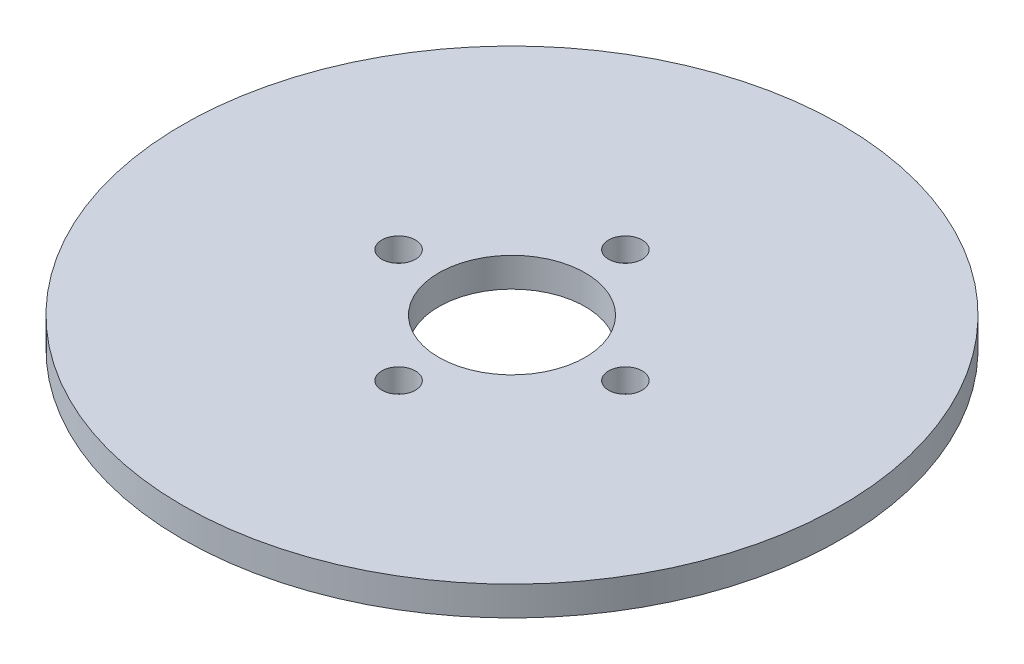
ISO-10303-21;
HEADER;
FILE_DESCRIPTION(('STEP AP214'),'2;1');
FILE_NAME('part.step','',(''),(''),'','','');
FILE_SCHEMA(('AUTOMOTIVE_DESIGN { 1 0 10303 214 1 1 1 1 }'));
ENDSEC;
DATA;
#1=APPLICATION_CONTEXT('core data for automotive mechanical design processes');
#2=APPLICATION_PROTOCOL_DEFINITION('international standard','automotive_design',2000,#1);
#3=PRODUCT_CONTEXT('',#1,'mechanical');
#4=PRODUCT('Part','Part','',(#3));
#5=PRODUCT_RELATED_PRODUCT_CATEGORY('part','',(#4));
#6=PRODUCT_DEFINITION_FORMATION('','',#4);
#7=PRODUCT_DEFINITION_CONTEXT('part definition',#1,'design');
#8=PRODUCT_DEFINITION('design','',#6,#7);
#9=PRODUCT_DEFINITION_SHAPE('','',#8);
#10=(LENGTH_UNIT() NAMED_UNIT(*) SI_UNIT(.MILLI.,.METRE.));
#11=(NAMED_UNIT(*) PLANE_ANGLE_UNIT() SI_UNIT($,.RADIAN.));
#12=(NAMED_UNIT(*) SI_UNIT($,.STERADIAN.) SOLID_ANGLE_UNIT());
#13=UNCERTAINTY_MEASURE_WITH_UNIT(LENGTH_MEASURE(1.E-05),#10,'distance_accuracy_value','');
#14=(GEOMETRIC_REPRESENTATION_CONTEXT(3) GLOBAL_UNCERTAINTY_ASSIGNED_CONTEXT((#13)) GLOBAL_UNIT_ASSIGNED_CONTEXT((#10,
#11,#12)) REPRESENTATION_CONTEXT('',''));
#15=CARTESIAN_POINT('',(0.,0.,0.));
#16=DIRECTION('',(0.,0.,1.));
#17=DIRECTION('',(1.,0.,0.));
#18=AXIS2_PLACEMENT_3D('',#15,#16,#17);
#19=CARTESIAN_POINT('',(0.,4.,0.));
#20=DIRECTION('',(0.,-1.,0.));
#21=DIRECTION('',(0.,0.,-1.));
#22=AXIS2_PLACEMENT_3D('',#19,#20,#21);
#23=CYLINDRICAL_SURFACE('',#22,45.);
#24=CARTESIAN_POINT('',(0.,4.,0.));
#25=DIRECTION('',(0.,1.,0.));
#26=DIRECTION('',(0.,0.,1.));
#27=AXIS2_PLACEMENT_3D('',#24,#25,#26);
#28=CIRCLE('',#27,45.);
#29=CARTESIAN_POINT('',(0.,4.,45.));
#30=VERTEX_POINT('',#29);
#31=EDGE_CURVE('E10',#30,#30,#28,.T.);
#32=ORIENTED_EDGE('',*,*,#31,.F.);
#33=EDGE_LOOP('',(#32));
#34=FACE_BOUND('',#33,.T.);
#35=CARTESIAN_POINT('',(0.,0.,0.));
#36=DIRECTION('',(0.,1.,0.));
#37=DIRECTION('',(0.,0.,1.));
#38=AXIS2_PLACEMENT_3D('',#35,#36,#37);
#39=CIRCLE('',#38,45.);
#40=CARTESIAN_POINT('',(0.,0.,45.));
#41=VERTEX_POINT('',#40);
#42=EDGE_CURVE('E37',#41,#41,#39,.T.);
#43=ORIENTED_EDGE('',*,*,#42,.T.);
#44=EDGE_LOOP('',(#43));
#45=FACE_BOUND('',#44,.T.);
#46=ADVANCED_FACE('F40',(#34,#45),#23,.T.);
#47=CARTESIAN_POINT('',(0.,4.,0.));
#48=DIRECTION('',(0.,1.,0.));
#49=DIRECTION('',(0.,0.,1.));
#50=AXIS2_PLACEMENT_3D('',#47,#48,#49);
#51=PLANE('',#50);
#52=CARTESIAN_POINT('',(0.,4.,15.4826287948138));
#53=DIRECTION('',(0.,1.,0.));
#54=DIRECTION('',(1.,0.,0.));
#55=AXIS2_PLACEMENT_3D('',#52,#53,#54);
#56=CIRCLE('',#55,2.29419777242178);
#57=CARTESIAN_POINT('',(2.29419777242184,4.,15.4826287948138));
#58=VERTEX_POINT('',#57);
#59=EDGE_CURVE('E71',#58,#58,#56,.T.);
#60=ORIENTED_EDGE('',*,*,#59,.F.);
#61=EDGE_LOOP('',(#60));
#62=FACE_BOUND('',#61,.T.);
#63=CARTESIAN_POINT('',(15.4826287948138,4.,0.));
#64=DIRECTION('',(0.,1.,0.));
#65=DIRECTION('',(0.,0.,-1.));
#66=AXIS2_PLACEMENT_3D('',#63,#64,#65);
#67=CIRCLE('',#66,2.29419777242178);
#68=CARTESIAN_POINT('',(15.4826287948138,4.,-2.29419777242178));
#69=VERTEX_POINT('',#68);
#70=EDGE_CURVE('E70',#69,#69,#67,.T.);
#71=ORIENTED_EDGE('',*,*,#70,.F.);
#72=EDGE_LOOP('',(#71));
#73=FACE_BOUND('',#72,.T.);
#74=CARTESIAN_POINT('',(-1.62171928539984E-13,4.,-15.4826287948138));
#75=DIRECTION('',(0.,1.,0.));
#76=DIRECTION('',(-1.,0.,0.));
#77=AXIS2_PLACEMENT_3D('',#74,#75,#76);
#78=CIRCLE('',#77,2.29419777242178);
#79=CARTESIAN_POINT('',(-2.29419777242195,4.,-15.4826287948138));
#80=VERTEX_POINT('',#79);
#81=EDGE_CURVE('E61',#80,#80,#78,.T.);
#82=ORIENTED_EDGE('',*,*,#81,.F.);
#83=EDGE_LOOP('',(#82));
#84=FACE_BOUND('',#83,.T.);
#85=CARTESIAN_POINT('',(-15.4826287948138,4.,0.));
#86=DIRECTION('',(0.,1.,0.));
#87=DIRECTION('',(0.,0.,1.));
#88=AXIS2_PLACEMENT_3D('',#85,#86,#87);
#89=CIRCLE('',#88,2.29419777242178);
#90=CARTESIAN_POINT('',(-15.4826287948138,4.,2.29419777242178));
#91=VERTEX_POINT('',#90);
#92=EDGE_CURVE('E54',#91,#91,#89,.T.);
#93=ORIENTED_EDGE('',*,*,#92,.F.);
#94=EDGE_LOOP('',(#93));
#95=FACE_BOUND('',#94,.T.);
#96=CARTESIAN_POINT('',(0.,4.,0.));
#97=DIRECTION('',(0.,1.,0.));
#98=DIRECTION('',(0.,0.,1.));
#99=AXIS2_PLACEMENT_3D('',#96,#97,#98);
#100=CIRCLE('',#99,10.);
#101=CARTESIAN_POINT('',(0.,4.,10.));
#102=VERTEX_POINT('',#101);
#103=EDGE_CURVE('E50',#102,#102,#100,.T.);
#104=ORIENTED_EDGE('',*,*,#103,.F.);
#105=EDGE_LOOP('',(#104));
#106=FACE_BOUND('',#105,.T.);
#107=ORIENTED_EDGE('',*,*,#31,.T.);
#108=EDGE_LOOP('',(#107));
#109=FACE_BOUND('',#108,.T.);
#110=ADVANCED_FACE('F86',(#62,#73,#84,#95,#106,#109),#51,.T.);
#111=CARTESIAN_POINT('',(0.,0.,0.));
#112=DIRECTION('',(0.,1.,0.));
#113=DIRECTION('',(0.,0.,1.));
#114=AXIS2_PLACEMENT_3D('',#111,#112,#113);
#115=PLANE('',#114);
#116=CARTESIAN_POINT('',(0.,0.,0.));
#117=DIRECTION('',(0.,1.,0.));
#118=DIRECTION('',(0.,0.,1.));
#119=AXIS2_PLACEMENT_3D('',#116,#117,#118);
#120=CIRCLE('',#119,10.);
#121=CARTESIAN_POINT('',(0.,0.,10.));
#122=VERTEX_POINT('',#121);
#123=EDGE_CURVE('E47',#122,#122,#120,.T.);
#124=ORIENTED_EDGE('',*,*,#123,.T.);
#125=EDGE_LOOP('',(#124));
#126=FACE_BOUND('',#125,.T.);
#127=ORIENTED_EDGE('',*,*,#42,.F.);
#128=EDGE_LOOP('',(#127));
#129=FACE_BOUND('',#128,.T.);
#130=ADVANCED_FACE('F93',(#126,#129),#115,.F.);
#131=CARTESIAN_POINT('',(0.,4.,0.));
#132=DIRECTION('',(0.,-1.,0.));
#133=DIRECTION('',(0.,0.,-1.));
#134=AXIS2_PLACEMENT_3D('',#131,#132,#133);
#135=CYLINDRICAL_SURFACE('',#134,10.);
#136=ORIENTED_EDGE('',*,*,#103,.T.);
#137=EDGE_LOOP('',(#136));
#138=FACE_BOUND('',#137,.T.);
#139=ORIENTED_EDGE('',*,*,#123,.F.);
#140=EDGE_LOOP('',(#139));
#141=FACE_BOUND('',#140,.T.);
#142=ADVANCED_FACE('F101',(#138,#141),#135,.F.);
#143=CARTESIAN_POINT('',(-15.4826287948138,0.819832797790124,0.));
#144=DIRECTION('',(0.,1.,0.));
#145=DIRECTION('',(0.,0.,1.));
#146=AXIS2_PLACEMENT_3D('',#143,#144,#145);
#147=CYLINDRICAL_SURFACE('',#146,2.29419777242178);
#148=CARTESIAN_POINT('',(-15.4826287948138,0.819832797790124,0.));
#149=DIRECTION('',(0.,1.,0.));
#150=DIRECTION('',(0.,0.,1.));
#151=AXIS2_PLACEMENT_3D('',#148,#149,#150);
#152=CIRCLE('',#151,2.29419777242178);
#153=CARTESIAN_POINT('',(-15.4826287948138,0.819832797790124,2.29419777242178));
#154=VERTEX_POINT('',#153);
#155=EDGE_CURVE('E55',#154,#154,#152,.T.);
#156=ORIENTED_EDGE('',*,*,#155,.F.);
#157=EDGE_LOOP('',(#156));
#158=FACE_BOUND('',#157,.T.);
#159=ORIENTED_EDGE('',*,*,#92,.T.);
#160=EDGE_LOOP('',(#159));
#161=FACE_BOUND('',#160,.T.);
#162=ADVANCED_FACE('F102',(#158,#161),#147,.F.);
#163=CARTESIAN_POINT('',(-15.4826287948138,0.819832797790124,0.));
#164=DIRECTION('',(0.,1.,0.));
#165=DIRECTION('',(0.,0.,1.));
#166=AXIS2_PLACEMENT_3D('',#163,#164,#165);
#167=PLANE('',#166);
#168=ORIENTED_EDGE('',*,*,#155,.T.);
#169=EDGE_LOOP('',(#168));
#170=FACE_BOUND('',#169,.T.);
#171=ADVANCED_FACE('F133',(#170),#167,.T.);
#172=CARTESIAN_POINT('',(-1.62171928539984E-13,0.819832797790124,-15.4826287948138));
#173=DIRECTION('',(0.,1.,0.));
#174=DIRECTION('',(0.,0.,1.));
#175=AXIS2_PLACEMENT_3D('',#172,#173,#174);
#176=CYLINDRICAL_SURFACE('',#175,2.29419777242178);
#177=CARTESIAN_POINT('',(-1.62171928539984E-13,0.819832797790124,-15.4826287948138));
#178=DIRECTION('',(0.,1.,0.));
#179=DIRECTION('',(-1.,0.,0.));
#180=AXIS2_PLACEMENT_3D('',#177,#178,#179);
#181=CIRCLE('',#180,2.29419777242178);
#182=CARTESIAN_POINT('',(-2.29419777242195,0.819832797790124,-15.4826287948138));
#183=VERTEX_POINT('',#182);
#184=EDGE_CURVE('E63',#183,#183,#181,.T.);
#185=ORIENTED_EDGE('',*,*,#184,.F.);
#186=EDGE_LOOP('',(#185));
#187=FACE_BOUND('',#186,.T.);
#188=ORIENTED_EDGE('',*,*,#81,.T.);
#189=EDGE_LOOP('',(#188));
#190=FACE_BOUND('',#189,.T.);
#191=ADVANCED_FACE('F142',(#187,#190),#176,.F.);
#192=CARTESIAN_POINT('',(-1.62171928539984E-13,0.819832797790124,-15.4826287948138));
#193=DIRECTION('',(0.,1.,0.));
#194=DIRECTION('',(-1.,0.,0.));
#195=AXIS2_PLACEMENT_3D('',#192,#193,#194);
#196=PLANE('',#195);
#197=ORIENTED_EDGE('',*,*,#184,.T.);
#198=EDGE_LOOP('',(#197));
#199=FACE_BOUND('',#198,.T.);
#200=ADVANCED_FACE('F156',(#199),#196,.T.);
#201=CARTESIAN_POINT('',(15.4826287948138,0.819832797790124,0.));
#202=DIRECTION('',(0.,1.,0.));
#203=DIRECTION('',(0.,0.,1.));
#204=AXIS2_PLACEMENT_3D('',#201,#202,#203);
#205=CYLINDRICAL_SURFACE('',#204,2.29419777242178);
#206=CARTESIAN_POINT('',(15.4826287948138,0.819832797790124,0.));
#207=DIRECTION('',(0.,1.,0.));
#208=DIRECTION('',(0.,0.,-1.));
#209=AXIS2_PLACEMENT_3D('',#206,#207,#208);
#210=CIRCLE('',#209,2.29419777242178);
#211=CARTESIAN_POINT('',(15.4826287948138,0.819832797790124,-2.29419777242178));
#212=VERTEX_POINT('',#211);
#213=EDGE_CURVE('E69',#212,#212,#210,.T.);
#214=ORIENTED_EDGE('',*,*,#213,.F.);
#215=EDGE_LOOP('',(#214));
#216=FACE_BOUND('',#215,.T.);
#217=ORIENTED_EDGE('',*,*,#70,.T.);
#218=EDGE_LOOP('',(#217));
#219=FACE_BOUND('',#218,.T.);
#220=ADVANCED_FACE('F164',(#216,#219),#205,.F.);
#221=CARTESIAN_POINT('',(15.4826287948138,0.819832797790124,0.));
#222=DIRECTION('',(0.,1.,0.));
#223=DIRECTION('',(0.,0.,-1.));
#224=AXIS2_PLACEMENT_3D('',#221,#222,#223);
#225=PLANE('',#224);
#226=ORIENTED_EDGE('',*,*,#213,.T.);
#227=EDGE_LOOP('',(#226));
#228=FACE_BOUND('',#227,.T.);
#229=ADVANCED_FACE('F83',(#228),#225,.T.);
#230=CARTESIAN_POINT('',(0.,0.819832797790124,15.4826287948138));
#231=DIRECTION('',(0.,1.,0.));
#232=DIRECTION('',(0.,0.,1.));
#233=AXIS2_PLACEMENT_3D('',#230,#231,#232);
#234=CYLINDRICAL_SURFACE('',#233,2.29419777242178);
#235=CARTESIAN_POINT('',(0.,0.819832797790124,15.4826287948138));
#236=DIRECTION('',(0.,1.,0.));
#237=DIRECTION('',(1.,0.,0.));
#238=AXIS2_PLACEMENT_3D('',#235,#236,#237);
#239=CIRCLE('',#238,2.29419777242178);
#240=CARTESIAN_POINT('',(2.29419777242184,0.819832797790124,15.4826287948138));
#241=VERTEX_POINT('',#240);
#242=EDGE_CURVE('E59',#241,#241,#239,.T.);
#243=ORIENTED_EDGE('',*,*,#242,.F.);
#244=EDGE_LOOP('',(#243));
#245=FACE_BOUND('',#244,.T.);
#246=ORIENTED_EDGE('',*,*,#59,.T.);
#247=EDGE_LOOP('',(#246));
#248=FACE_BOUND('',#247,.T.);
#249=ADVANCED_FACE('F81',(#245,#248),#234,.F.);
#250=CARTESIAN_POINT('',(0.,0.819832797790124,15.4826287948138));
#251=DIRECTION('',(0.,1.,0.));
#252=DIRECTION('',(1.,0.,0.));
#253=AXIS2_PLACEMENT_3D('',#250,#251,#252);
#254=PLANE('',#253);
#255=ORIENTED_EDGE('',*,*,#242,.T.);
#256=EDGE_LOOP('',(#255));
#257=FACE_BOUND('',#256,.T.);
#258=ADVANCED_FACE('F78',(#257),#254,.T.);
#259=CLOSED_SHELL('',(#46,#110,#130,#142,#162,#171,#191,#200,#220,#229,#249,#258));
#260=MANIFOLD_SOLID_BREP('B2',#259);
#261=ADVANCED_BREP_SHAPE_REPRESENTATION('',(#18,#260),#14);
#262=SHAPE_DEFINITION_REPRESENTATION(#9,#261);
ENDSEC;
END-ISO-10303-21;
